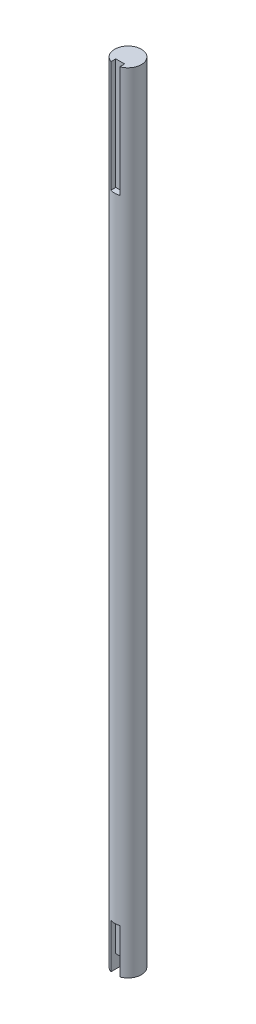
ISO-10303-21;
HEADER;
FILE_DESCRIPTION(('STEP AP214'),'2;1');
FILE_NAME('part.step','',(''),(''),'','','');
FILE_SCHEMA(('AUTOMOTIVE_DESIGN { 1 0 10303 214 1 1 1 1 }'));
ENDSEC;
DATA;
#1=APPLICATION_CONTEXT('core data for automotive mechanical design processes');
#2=APPLICATION_PROTOCOL_DEFINITION('international standard','automotive_design',2000,#1);
#3=PRODUCT_CONTEXT('',#1,'mechanical');
#4=PRODUCT('Part','Part','',(#3));
#5=PRODUCT_RELATED_PRODUCT_CATEGORY('part','',(#4));
#6=PRODUCT_DEFINITION_FORMATION('','',#4);
#7=PRODUCT_DEFINITION_CONTEXT('part definition',#1,'design');
#8=PRODUCT_DEFINITION('design','',#6,#7);
#9=PRODUCT_DEFINITION_SHAPE('','',#8);
#10=(LENGTH_UNIT() NAMED_UNIT(*) SI_UNIT(.MILLI.,.METRE.));
#11=(NAMED_UNIT(*) PLANE_ANGLE_UNIT() SI_UNIT($,.RADIAN.));
#12=(NAMED_UNIT(*) SI_UNIT($,.STERADIAN.) SOLID_ANGLE_UNIT());
#13=UNCERTAINTY_MEASURE_WITH_UNIT(LENGTH_MEASURE(1.E-05),#10,'distance_accuracy_value','');
#14=(GEOMETRIC_REPRESENTATION_CONTEXT(3) GLOBAL_UNCERTAINTY_ASSIGNED_CONTEXT((#13)) GLOBAL_UNIT_ASSIGNED_CONTEXT((#10,
#11,#12)) REPRESENTATION_CONTEXT('',''));
#15=CARTESIAN_POINT('',(0.,0.,0.));
#16=DIRECTION('',(0.,0.,1.));
#17=DIRECTION('',(1.,0.,0.));
#18=AXIS2_PLACEMENT_3D('',#15,#16,#17);
#19=CARTESIAN_POINT('',(0.,-100.,0.));
#20=DIRECTION('',(0.,1.,0.));
#21=DIRECTION('',(0.,0.,1.));
#22=AXIS2_PLACEMENT_3D('',#19,#20,#21);
#23=PLANE('',#22);
#24=DIRECTION('',(0.,0.,1.));
#25=VECTOR('',#24,1.);
#26=CARTESIAN_POINT('',(2.,-100.,0.));
#27=LINE('',#26,#25);
#28=CARTESIAN_POINT('',(2.,-100.,1.));
#29=VERTEX_POINT('',#28);
#30=CARTESIAN_POINT('',(2.,-100.,5.65685424949238));
#31=VERTEX_POINT('',#30);
#32=EDGE_CURVE('E184',#29,#31,#27,.T.);
#33=ORIENTED_EDGE('',*,*,#32,.F.);
#34=DIRECTION('',(-1.,0.,0.));
#35=VECTOR('',#34,1.);
#36=CARTESIAN_POINT('',(0.,-100.,1.));
#37=LINE('',#36,#35);
#38=CARTESIAN_POINT('',(-2.,-100.,0.999999999999999));
#39=VERTEX_POINT('',#38);
#40=EDGE_CURVE('E121',#29,#39,#37,.T.);
#41=ORIENTED_EDGE('',*,*,#40,.T.);
#42=DIRECTION('',(0.,0.,-1.));
#43=VECTOR('',#42,1.);
#44=CARTESIAN_POINT('',(-2.,-100.,0.));
#45=LINE('',#44,#43);
#46=CARTESIAN_POINT('',(-2.,-100.,5.65685424949238));
#47=VERTEX_POINT('',#46);
#48=EDGE_CURVE('E182',#47,#39,#45,.T.);
#49=ORIENTED_EDGE('',*,*,#48,.F.);
#50=CARTESIAN_POINT('',(0.,-100.,0.));
#51=DIRECTION('',(0.,1.,0.));
#52=DIRECTION('',(0.,0.,1.));
#53=AXIS2_PLACEMENT_3D('',#50,#51,#52);
#54=CIRCLE('',#53,6.);
#55=EDGE_CURVE('E179',#31,#47,#54,.T.);
#56=ORIENTED_EDGE('',*,*,#55,.F.);
#57=EDGE_LOOP('',(#33,#41,#49,#56));
#58=FACE_BOUND('',#57,.T.);
#59=ADVANCED_FACE('F36',(#58),#23,.F.);
#60=CARTESIAN_POINT('',(0.,-100.,0.));
#61=DIRECTION('',(0.,1.,0.));
#62=DIRECTION('',(0.,0.,1.));
#63=AXIS2_PLACEMENT_3D('',#60,#61,#62);
#64=CYLINDRICAL_SURFACE('',#63,6.);
#65=CARTESIAN_POINT('',(0.,-80.,0.));
#66=DIRECTION('',(0.,1.,0.));
#67=DIRECTION('',(0.,0.,1.));
#68=AXIS2_PLACEMENT_3D('',#65,#66,#67);
#69=CIRCLE('',#68,6.);
#70=CARTESIAN_POINT('',(2.,-80.,5.65685424949238));
#71=VERTEX_POINT('',#70);
#72=CARTESIAN_POINT('',(-2.,-80.,5.65685424949238));
#73=VERTEX_POINT('',#72);
#74=EDGE_CURVE('E186',#71,#73,#69,.F.);
#75=ORIENTED_EDGE('',*,*,#74,.F.);
#76=DIRECTION('',(0.,1.,0.));
#77=VECTOR('',#76,1.);
#78=CARTESIAN_POINT('',(2.,-100.,5.65685424949238));
#79=LINE('',#78,#77);
#80=EDGE_CURVE('E174',#71,#31,#79,.F.);
#81=ORIENTED_EDGE('',*,*,#80,.T.);
#82=ORIENTED_EDGE('',*,*,#55,.T.);
#83=DIRECTION('',(0.,1.,0.));
#84=VECTOR('',#83,1.);
#85=CARTESIAN_POINT('',(-2.,-100.,5.65685424949238));
#86=LINE('',#85,#84);
#87=EDGE_CURVE('E172',#47,#73,#86,.T.);
#88=ORIENTED_EDGE('',*,*,#87,.T.);
#89=EDGE_LOOP('',(#75,#81,#82,#88));
#90=FACE_BOUND('',#89,.T.);
#91=CARTESIAN_POINT('',(0.,204.,0.));
#92=DIRECTION('',(0.,-1.,0.));
#93=DIRECTION('',(0.,0.,-1.));
#94=AXIS2_PLACEMENT_3D('',#91,#92,#93);
#95=CIRCLE('',#94,6.);
#96=CARTESIAN_POINT('',(-2.,204.,5.65685424949238));
#97=VERTEX_POINT('',#96);
#98=CARTESIAN_POINT('',(2.,204.,5.65685424949238));
#99=VERTEX_POINT('',#98);
#100=EDGE_CURVE('E11',#97,#99,#95,.F.);
#101=ORIENTED_EDGE('',*,*,#100,.F.);
#102=DIRECTION('',(0.,1.,0.));
#103=VECTOR('',#102,1.);
#104=CARTESIAN_POINT('',(-2.,-100.,5.65685424949238));
#105=LINE('',#104,#103);
#106=CARTESIAN_POINT('',(-2.,254.,5.65685424949238));
#107=VERTEX_POINT('',#106);
#108=EDGE_CURVE('E158',#97,#107,#105,.T.);
#109=ORIENTED_EDGE('',*,*,#108,.T.);
#110=CARTESIAN_POINT('',(0.,254.,0.));
#111=DIRECTION('',(0.,1.,0.));
#112=DIRECTION('',(0.,0.,1.));
#113=AXIS2_PLACEMENT_3D('',#110,#111,#112);
#114=CIRCLE('',#113,6.);
#115=CARTESIAN_POINT('',(2.,254.,5.65685424949238));
#116=VERTEX_POINT('',#115);
#117=EDGE_CURVE('E176',#116,#107,#114,.T.);
#118=ORIENTED_EDGE('',*,*,#117,.F.);
#119=DIRECTION('',(0.,1.,0.));
#120=VECTOR('',#119,1.);
#121=CARTESIAN_POINT('',(2.,-100.,5.65685424949238));
#122=LINE('',#121,#120);
#123=EDGE_CURVE('E59',#116,#99,#122,.F.);
#124=ORIENTED_EDGE('',*,*,#123,.T.);
#125=EDGE_LOOP('',(#101,#109,#118,#124));
#126=FACE_BOUND('',#125,.T.);
#127=ADVANCED_FACE('F38',(#90,#126),#64,.T.);
#128=CARTESIAN_POINT('',(0.,254.,0.));
#129=DIRECTION('',(0.,1.,0.));
#130=DIRECTION('',(0.,0.,1.));
#131=AXIS2_PLACEMENT_3D('',#128,#129,#130);
#132=PLANE('',#131);
#133=ORIENTED_EDGE('',*,*,#117,.T.);
#134=DIRECTION('',(0.,0.,-1.));
#135=VECTOR('',#134,1.);
#136=CARTESIAN_POINT('',(-2.,254.,0.));
#137=LINE('',#136,#135);
#138=CARTESIAN_POINT('',(-2.,254.,3.5));
#139=VERTEX_POINT('',#138);
#140=EDGE_CURVE('E44',#107,#139,#137,.T.);
#141=ORIENTED_EDGE('',*,*,#140,.T.);
#142=DIRECTION('',(1.,0.,0.));
#143=VECTOR('',#142,1.);
#144=CARTESIAN_POINT('',(0.,254.,3.5));
#145=LINE('',#144,#143);
#146=CARTESIAN_POINT('',(2.,254.,3.5));
#147=VERTEX_POINT('',#146);
#148=EDGE_CURVE('E137',#139,#147,#145,.T.);
#149=ORIENTED_EDGE('',*,*,#148,.T.);
#150=DIRECTION('',(0.,0.,1.));
#151=VECTOR('',#150,1.);
#152=CARTESIAN_POINT('',(2.,254.,0.));
#153=LINE('',#152,#151);
#154=EDGE_CURVE('E145',#147,#116,#153,.T.);
#155=ORIENTED_EDGE('',*,*,#154,.T.);
#156=EDGE_LOOP('',(#133,#141,#149,#155));
#157=FACE_BOUND('',#156,.T.);
#158=ADVANCED_FACE('F190',(#157),#132,.T.);
#159=CARTESIAN_POINT('',(0.,-80.,3.5));
#160=DIRECTION('',(0.,0.,1.));
#161=DIRECTION('',(1.,0.,0.));
#162=AXIS2_PLACEMENT_3D('',#159,#160,#161);
#163=PLANE('',#162);
#164=DIRECTION('',(-1.,0.,0.));
#165=VECTOR('',#164,1.);
#166=CARTESIAN_POINT('',(0.,-94.,3.5));
#167=LINE('',#166,#165);
#168=CARTESIAN_POINT('',(2.,-94.,3.5));
#169=VERTEX_POINT('',#168);
#170=CARTESIAN_POINT('',(-2.,-94.,3.5));
#171=VERTEX_POINT('',#170);
#172=EDGE_CURVE('E134',#169,#171,#167,.T.);
#173=ORIENTED_EDGE('',*,*,#172,.F.);
#174=DIRECTION('',(0.,-1.,0.));
#175=VECTOR('',#174,1.);
#176=CARTESIAN_POINT('',(2.,-80.,3.5));
#177=LINE('',#176,#175);
#178=CARTESIAN_POINT('',(2.,-80.,3.5));
#179=VERTEX_POINT('',#178);
#180=EDGE_CURVE('E119',#179,#169,#177,.T.);
#181=ORIENTED_EDGE('',*,*,#180,.F.);
#182=DIRECTION('',(-1.,0.,0.));
#183=VECTOR('',#182,1.);
#184=CARTESIAN_POINT('',(0.,-80.,3.5));
#185=LINE('',#184,#183);
#186=CARTESIAN_POINT('',(-2.,-80.,3.5));
#187=VERTEX_POINT('',#186);
#188=EDGE_CURVE('E163',#179,#187,#185,.T.);
#189=ORIENTED_EDGE('',*,*,#188,.T.);
#190=DIRECTION('',(0.,-1.,0.));
#191=VECTOR('',#190,1.);
#192=CARTESIAN_POINT('',(-2.,-80.,3.5));
#193=LINE('',#192,#191);
#194=EDGE_CURVE('E168',#187,#171,#193,.T.);
#195=ORIENTED_EDGE('',*,*,#194,.T.);
#196=EDGE_LOOP('',(#173,#181,#189,#195));
#197=FACE_BOUND('',#196,.T.);
#198=ADVANCED_FACE('F224',(#197),#163,.T.);
#199=CARTESIAN_POINT('',(2.,-80.,0.));
#200=DIRECTION('',(-1.,0.,0.));
#201=DIRECTION('',(0.,0.,1.));
#202=AXIS2_PLACEMENT_3D('',#199,#200,#201);
#203=PLANE('',#202);
#204=ORIENTED_EDGE('',*,*,#180,.T.);
#205=DIRECTION('',(0.,0.,-1.));
#206=VECTOR('',#205,1.);
#207=CARTESIAN_POINT('',(2.,-94.,0.));
#208=LINE('',#207,#206);
#209=CARTESIAN_POINT('',(2.,-94.,1.));
#210=VERTEX_POINT('',#209);
#211=EDGE_CURVE('E51',#169,#210,#208,.T.);
#212=ORIENTED_EDGE('',*,*,#211,.T.);
#213=DIRECTION('',(0.,-1.,0.));
#214=VECTOR('',#213,1.);
#215=CARTESIAN_POINT('',(2.,-94.,1.));
#216=LINE('',#215,#214);
#217=EDGE_CURVE('E117',#210,#29,#216,.T.);
#218=ORIENTED_EDGE('',*,*,#217,.T.);
#219=ORIENTED_EDGE('',*,*,#32,.T.);
#220=ORIENTED_EDGE('',*,*,#80,.F.);
#221=DIRECTION('',(0.,0.,-1.));
#222=VECTOR('',#221,1.);
#223=CARTESIAN_POINT('',(2.,-80.,0.));
#224=LINE('',#223,#222);
#225=EDGE_CURVE('E161',#71,#179,#224,.T.);
#226=ORIENTED_EDGE('',*,*,#225,.T.);
#227=EDGE_LOOP('',(#204,#212,#218,#219,#220,#226));
#228=FACE_BOUND('',#227,.T.);
#229=ADVANCED_FACE('F114',(#228),#203,.T.);
#230=CARTESIAN_POINT('',(-2.,-80.,0.));
#231=DIRECTION('',(1.,0.,0.));
#232=DIRECTION('',(0.,0.,-1.));
#233=AXIS2_PLACEMENT_3D('',#230,#231,#232);
#234=PLANE('',#233);
#235=DIRECTION('',(0.,0.,1.));
#236=VECTOR('',#235,1.);
#237=CARTESIAN_POINT('',(-2.,-80.,0.));
#238=LINE('',#237,#236);
#239=EDGE_CURVE('E165',#187,#73,#238,.T.);
#240=ORIENTED_EDGE('',*,*,#239,.T.);
#241=ORIENTED_EDGE('',*,*,#87,.F.);
#242=ORIENTED_EDGE('',*,*,#48,.T.);
#243=DIRECTION('',(0.,-1.,0.));
#244=VECTOR('',#243,1.);
#245=CARTESIAN_POINT('',(-2.,-94.,0.999999999999999));
#246=LINE('',#245,#244);
#247=CARTESIAN_POINT('',(-2.,-94.,0.999999999999999));
#248=VERTEX_POINT('',#247);
#249=EDGE_CURVE('E135',#248,#39,#246,.T.);
#250=ORIENTED_EDGE('',*,*,#249,.F.);
#251=DIRECTION('',(0.,0.,1.));
#252=VECTOR('',#251,1.);
#253=CARTESIAN_POINT('',(-2.,-94.,0.));
#254=LINE('',#253,#252);
#255=EDGE_CURVE('E126',#248,#171,#254,.T.);
#256=ORIENTED_EDGE('',*,*,#255,.T.);
#257=ORIENTED_EDGE('',*,*,#194,.F.);
#258=EDGE_LOOP('',(#240,#241,#242,#250,#256,#257));
#259=FACE_BOUND('',#258,.T.);
#260=ADVANCED_FACE('F227',(#259),#234,.T.);
#261=CARTESIAN_POINT('',(0.,-80.,0.));
#262=DIRECTION('',(0.,1.,0.));
#263=DIRECTION('',(0.,0.,1.));
#264=AXIS2_PLACEMENT_3D('',#261,#262,#263);
#265=PLANE('',#264);
#266=ORIENTED_EDGE('',*,*,#74,.T.);
#267=ORIENTED_EDGE('',*,*,#239,.F.);
#268=ORIENTED_EDGE('',*,*,#188,.F.);
#269=ORIENTED_EDGE('',*,*,#225,.F.);
#270=EDGE_LOOP('',(#266,#267,#268,#269));
#271=FACE_BOUND('',#270,.T.);
#272=ADVANCED_FACE('F213',(#271),#265,.F.);
#273=CARTESIAN_POINT('',(-2.,204.,0.));
#274=DIRECTION('',(1.,0.,0.));
#275=DIRECTION('',(0.,0.,-1.));
#276=AXIS2_PLACEMENT_3D('',#273,#274,#275);
#277=PLANE('',#276);
#278=DIRECTION('',(0.,0.,-1.));
#279=VECTOR('',#278,1.);
#280=CARTESIAN_POINT('',(-2.,204.,0.));
#281=LINE('',#280,#279);
#282=CARTESIAN_POINT('',(-2.,204.,3.5));
#283=VERTEX_POINT('',#282);
#284=EDGE_CURVE('E142',#97,#283,#281,.T.);
#285=ORIENTED_EDGE('',*,*,#284,.T.);
#286=DIRECTION('',(0.,1.,0.));
#287=VECTOR('',#286,1.);
#288=CARTESIAN_POINT('',(-2.,204.,3.5));
#289=LINE('',#288,#287);
#290=EDGE_CURVE('E154',#283,#139,#289,.T.);
#291=ORIENTED_EDGE('',*,*,#290,.T.);
#292=ORIENTED_EDGE('',*,*,#140,.F.);
#293=ORIENTED_EDGE('',*,*,#108,.F.);
#294=EDGE_LOOP('',(#285,#291,#292,#293));
#295=FACE_BOUND('',#294,.T.);
#296=ADVANCED_FACE('F193',(#295),#277,.T.);
#297=CARTESIAN_POINT('',(0.,204.,3.5));
#298=DIRECTION('',(0.,0.,1.));
#299=DIRECTION('',(1.,0.,0.));
#300=AXIS2_PLACEMENT_3D('',#297,#298,#299);
#301=PLANE('',#300);
#302=ORIENTED_EDGE('',*,*,#148,.F.);
#303=ORIENTED_EDGE('',*,*,#290,.F.);
#304=DIRECTION('',(1.,0.,0.));
#305=VECTOR('',#304,1.);
#306=CARTESIAN_POINT('',(0.,204.,3.5));
#307=LINE('',#306,#305);
#308=CARTESIAN_POINT('',(2.,204.,3.5));
#309=VERTEX_POINT('',#308);
#310=EDGE_CURVE('E144',#283,#309,#307,.T.);
#311=ORIENTED_EDGE('',*,*,#310,.T.);
#312=DIRECTION('',(0.,1.,0.));
#313=VECTOR('',#312,1.);
#314=CARTESIAN_POINT('',(2.,204.,3.5));
#315=LINE('',#314,#313);
#316=EDGE_CURVE('E149',#309,#147,#315,.T.);
#317=ORIENTED_EDGE('',*,*,#316,.T.);
#318=EDGE_LOOP('',(#302,#303,#311,#317));
#319=FACE_BOUND('',#318,.T.);
#320=ADVANCED_FACE('F205',(#319),#301,.T.);
#321=CARTESIAN_POINT('',(2.,204.,0.));
#322=DIRECTION('',(-1.,0.,0.));
#323=DIRECTION('',(0.,0.,1.));
#324=AXIS2_PLACEMENT_3D('',#321,#322,#323);
#325=PLANE('',#324);
#326=ORIENTED_EDGE('',*,*,#154,.F.);
#327=ORIENTED_EDGE('',*,*,#316,.F.);
#328=DIRECTION('',(0.,0.,1.));
#329=VECTOR('',#328,1.);
#330=CARTESIAN_POINT('',(2.,204.,0.));
#331=LINE('',#330,#329);
#332=EDGE_CURVE('E147',#309,#99,#331,.T.);
#333=ORIENTED_EDGE('',*,*,#332,.T.);
#334=ORIENTED_EDGE('',*,*,#123,.F.);
#335=EDGE_LOOP('',(#326,#327,#333,#334));
#336=FACE_BOUND('',#335,.T.);
#337=ADVANCED_FACE('F203',(#336),#325,.T.);
#338=CARTESIAN_POINT('',(0.,204.,0.));
#339=DIRECTION('',(0.,-1.,0.));
#340=DIRECTION('',(0.,0.,-1.));
#341=AXIS2_PLACEMENT_3D('',#338,#339,#340);
#342=PLANE('',#341);
#343=ORIENTED_EDGE('',*,*,#100,.T.);
#344=ORIENTED_EDGE('',*,*,#332,.F.);
#345=ORIENTED_EDGE('',*,*,#310,.F.);
#346=ORIENTED_EDGE('',*,*,#284,.F.);
#347=EDGE_LOOP('',(#343,#344,#345,#346));
#348=FACE_BOUND('',#347,.T.);
#349=ADVANCED_FACE('F200',(#348),#342,.F.);
#350=CARTESIAN_POINT('',(0.,-94.,1.));
#351=DIRECTION('',(0.,0.,1.));
#352=DIRECTION('',(1.,0.,0.));
#353=AXIS2_PLACEMENT_3D('',#350,#351,#352);
#354=PLANE('',#353);
#355=ORIENTED_EDGE('',*,*,#40,.F.);
#356=ORIENTED_EDGE('',*,*,#217,.F.);
#357=DIRECTION('',(-1.,0.,0.));
#358=VECTOR('',#357,1.);
#359=CARTESIAN_POINT('',(0.,-94.,1.));
#360=LINE('',#359,#358);
#361=EDGE_CURVE('E120',#210,#248,#360,.T.);
#362=ORIENTED_EDGE('',*,*,#361,.T.);
#363=ORIENTED_EDGE('',*,*,#249,.T.);
#364=EDGE_LOOP('',(#355,#356,#362,#363));
#365=FACE_BOUND('',#364,.T.);
#366=ADVANCED_FACE('F132',(#365),#354,.T.);
#367=CARTESIAN_POINT('',(0.,-94.,0.));
#368=DIRECTION('',(0.,1.,0.));
#369=DIRECTION('',(0.,0.,1.));
#370=AXIS2_PLACEMENT_3D('',#367,#368,#369);
#371=PLANE('',#370);
#372=ORIENTED_EDGE('',*,*,#172,.T.);
#373=ORIENTED_EDGE('',*,*,#255,.F.);
#374=ORIENTED_EDGE('',*,*,#361,.F.);
#375=ORIENTED_EDGE('',*,*,#211,.F.);
#376=EDGE_LOOP('',(#372,#373,#374,#375));
#377=FACE_BOUND('',#376,.T.);
#378=ADVANCED_FACE('F124',(#377),#371,.F.);
#379=CLOSED_SHELL('',(#59,#127,#158,#198,#229,#260,#272,#296,#320,#337,#349,#366,#378));
#380=MANIFOLD_SOLID_BREP('B2',#379);
#381=ADVANCED_BREP_SHAPE_REPRESENTATION('',(#18,#380),#14);
#382=SHAPE_DEFINITION_REPRESENTATION(#9,#381);
ENDSEC;
END-ISO-10303-21;
